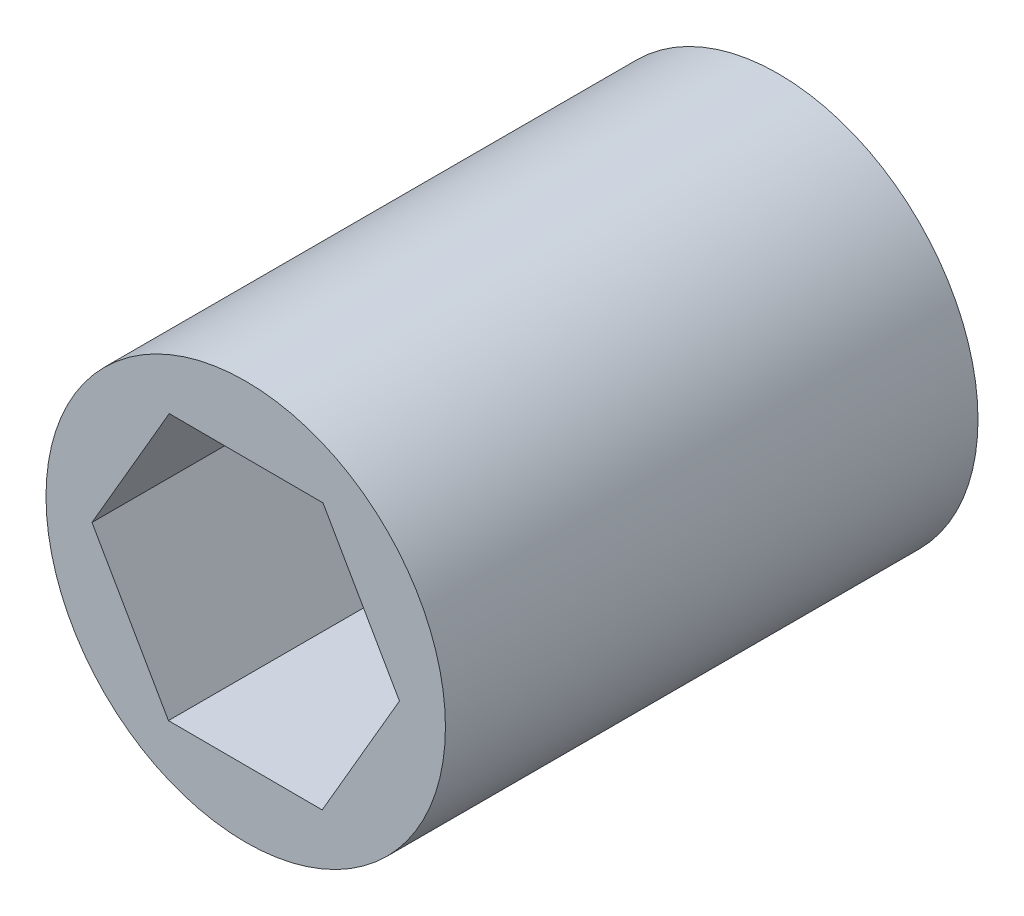
ISO-10303-21;
HEADER;
FILE_DESCRIPTION(('STEP AP214'),'2;1');
FILE_NAME('part.step','',(''),(''),'','','');
FILE_SCHEMA(('AUTOMOTIVE_DESIGN { 1 0 10303 214 1 1 1 1 }'));
ENDSEC;
DATA;
#1=APPLICATION_CONTEXT('core data for automotive mechanical design processes');
#2=APPLICATION_PROTOCOL_DEFINITION('international standard','automotive_design',2000,#1);
#3=PRODUCT_CONTEXT('',#1,'mechanical');
#4=PRODUCT('Part','Part','',(#3));
#5=PRODUCT_RELATED_PRODUCT_CATEGORY('part','',(#4));
#6=PRODUCT_DEFINITION_FORMATION('','',#4);
#7=PRODUCT_DEFINITION_CONTEXT('part definition',#1,'design');
#8=PRODUCT_DEFINITION('design','',#6,#7);
#9=PRODUCT_DEFINITION_SHAPE('','',#8);
#10=(LENGTH_UNIT() NAMED_UNIT(*) SI_UNIT(.MILLI.,.METRE.));
#11=(NAMED_UNIT(*) PLANE_ANGLE_UNIT() SI_UNIT($,.RADIAN.));
#12=(NAMED_UNIT(*) SI_UNIT($,.STERADIAN.) SOLID_ANGLE_UNIT());
#13=UNCERTAINTY_MEASURE_WITH_UNIT(LENGTH_MEASURE(1.E-05),#10,'distance_accuracy_value','');
#14=(GEOMETRIC_REPRESENTATION_CONTEXT(3) GLOBAL_UNCERTAINTY_ASSIGNED_CONTEXT((#13)) GLOBAL_UNIT_ASSIGNED_CONTEXT((#10,
#11,#12)) REPRESENTATION_CONTEXT('',''));
#15=CARTESIAN_POINT('',(0.,0.,0.));
#16=DIRECTION('',(0.,0.,1.));
#17=DIRECTION('',(1.,0.,0.));
#18=AXIS2_PLACEMENT_3D('',#15,#16,#17);
#19=CARTESIAN_POINT('',(0.,0.,25.4));
#20=DIRECTION('',(0.,0.,1.));
#21=DIRECTION('',(1.,0.,0.));
#22=AXIS2_PLACEMENT_3D('',#19,#20,#21);
#23=PLANE('',#22);
#24=CARTESIAN_POINT('',(0.,0.,25.4));
#25=DIRECTION('',(0.,0.,1.));
#26=DIRECTION('',(1.,0.,0.));
#27=AXIS2_PLACEMENT_3D('',#24,#25,#26);
#28=CIRCLE('',#27,9.525);
#29=CARTESIAN_POINT('',(9.525,0.,25.4));
#30=VERTEX_POINT('',#29);
#31=EDGE_CURVE('E11',#30,#30,#28,.T.);
#32=ORIENTED_EDGE('',*,*,#31,.T.);
#33=EDGE_LOOP('',(#32));
#34=FACE_BOUND('',#33,.T.);
#35=DIRECTION('',(0.502611333572125,0.864512491156056,0.));
#36=VECTOR('',#35,1.);
#37=CARTESIAN_POINT('',(3.64699361036975,-6.36103536692381,25.4));
#38=LINE('',#37,#36);
#39=CARTESIAN_POINT('',(3.64699361036975,-6.36103536692381,25.4));
#40=VERTEX_POINT('',#39);
#41=CARTESIAN_POINT('',(7.33231502731217,-0.0221285694421737,25.4));
#42=VERTEX_POINT('',#41);
#43=EDGE_CURVE('E100',#40,#42,#38,.T.);
#44=ORIENTED_EDGE('',*,*,#43,.F.);
#45=DIRECTION('',(0.999995446016177,-0.00301793752540637,0.));
#46=VECTOR('',#45,1.);
#47=CARTESIAN_POINT('',(-3.68532141694241,-6.33890679748164,25.4));
#48=LINE('',#47,#46);
#49=CARTESIAN_POINT('',(-3.68532141694241,-6.33890679748164,25.4));
#50=VERTEX_POINT('',#49);
#51=EDGE_CURVE('E92',#50,#40,#48,.T.);
#52=ORIENTED_EDGE('',*,*,#51,.F.);
#53=DIRECTION('',(0.497384112444053,-0.867530428681462,0.));
#54=VECTOR('',#53,1.);
#55=CARTESIAN_POINT('',(-7.33231502731217,0.022128569442172,25.4));
#56=LINE('',#55,#54);
#57=CARTESIAN_POINT('',(-7.33231502731217,0.022128569442172,25.4));
#58=VERTEX_POINT('',#57);
#59=EDGE_CURVE('E120',#58,#50,#56,.T.);
#60=ORIENTED_EDGE('',*,*,#59,.F.);
#61=DIRECTION('',(-0.502611333572125,-0.864512491156056,0.));
#62=VECTOR('',#61,1.);
#63=CARTESIAN_POINT('',(-3.64699361036976,6.36103536692381,25.4));
#64=LINE('',#63,#62);
#65=CARTESIAN_POINT('',(-3.64699361036976,6.36103536692381,25.4));
#66=VERTEX_POINT('',#65);
#67=EDGE_CURVE('E118',#66,#58,#64,.T.);
#68=ORIENTED_EDGE('',*,*,#67,.F.);
#69=DIRECTION('',(-0.999995446016177,0.00301793752540602,0.));
#70=VECTOR('',#69,1.);
#71=CARTESIAN_POINT('',(3.68532141694241,6.33890679748164,25.4));
#72=LINE('',#71,#70);
#73=CARTESIAN_POINT('',(3.68532141694241,6.33890679748164,25.4));
#74=VERTEX_POINT('',#73);
#75=EDGE_CURVE('E114',#74,#66,#72,.T.);
#76=ORIENTED_EDGE('',*,*,#75,.F.);
#77=DIRECTION('',(-0.497384112444053,0.867530428681462,0.));
#78=VECTOR('',#77,1.);
#79=CARTESIAN_POINT('',(7.33231502731217,-0.0221285694421737,25.4));
#80=LINE('',#79,#78);
#81=EDGE_CURVE('E112',#42,#74,#80,.T.);
#82=ORIENTED_EDGE('',*,*,#81,.F.);
#83=EDGE_LOOP('',(#44,#52,#60,#68,#76,#82));
#84=FACE_BOUND('',#83,.T.);
#85=ADVANCED_FACE('F39',(#34,#84),#23,.T.);
#86=CARTESIAN_POINT('',(0.,0.,0.));
#87=DIRECTION('',(0.,0.,1.));
#88=DIRECTION('',(1.,0.,0.));
#89=AXIS2_PLACEMENT_3D('',#86,#87,#88);
#90=PLANE('',#89);
#91=CARTESIAN_POINT('',(0.,0.,0.));
#92=DIRECTION('',(0.,0.,1.));
#93=DIRECTION('',(1.,0.,0.));
#94=AXIS2_PLACEMENT_3D('',#91,#92,#93);
#95=CIRCLE('',#94,9.525);
#96=CARTESIAN_POINT('',(9.525,0.,0.));
#97=VERTEX_POINT('',#96);
#98=EDGE_CURVE('E43',#97,#97,#95,.T.);
#99=ORIENTED_EDGE('',*,*,#98,.F.);
#100=EDGE_LOOP('',(#99));
#101=FACE_BOUND('',#100,.T.);
#102=DIRECTION('',(0.999995446016177,-0.00301793752540637,0.));
#103=VECTOR('',#102,1.);
#104=CARTESIAN_POINT('',(-3.68532141694241,-6.33890679748164,0.));
#105=LINE('',#104,#103);
#106=CARTESIAN_POINT('',(-3.68532141694241,-6.33890679748164,0.));
#107=VERTEX_POINT('',#106);
#108=CARTESIAN_POINT('',(3.64699361036975,-6.36103536692381,0.));
#109=VERTEX_POINT('',#108);
#110=EDGE_CURVE('E62',#107,#109,#105,.T.);
#111=ORIENTED_EDGE('',*,*,#110,.T.);
#112=DIRECTION('',(0.502611333572125,0.864512491156056,0.));
#113=VECTOR('',#112,1.);
#114=CARTESIAN_POINT('',(3.64699361036975,-6.36103536692381,0.));
#115=LINE('',#114,#113);
#116=CARTESIAN_POINT('',(7.33231502731217,-0.0221285694421737,0.));
#117=VERTEX_POINT('',#116);
#118=EDGE_CURVE('E107',#109,#117,#115,.T.);
#119=ORIENTED_EDGE('',*,*,#118,.T.);
#120=DIRECTION('',(-0.497384112444053,0.867530428681462,0.));
#121=VECTOR('',#120,1.);
#122=CARTESIAN_POINT('',(7.33231502731217,-0.0221285694421737,0.));
#123=LINE('',#122,#121);
#124=CARTESIAN_POINT('',(3.68532141694241,6.33890679748164,0.));
#125=VERTEX_POINT('',#124);
#126=EDGE_CURVE('E124',#117,#125,#123,.T.);
#127=ORIENTED_EDGE('',*,*,#126,.T.);
#128=DIRECTION('',(-0.999995446016177,0.00301793752540602,0.));
#129=VECTOR('',#128,1.);
#130=CARTESIAN_POINT('',(3.68532141694241,6.33890679748164,0.));
#131=LINE('',#130,#129);
#132=CARTESIAN_POINT('',(-3.64699361036976,6.36103536692381,0.));
#133=VERTEX_POINT('',#132);
#134=EDGE_CURVE('E127',#125,#133,#131,.T.);
#135=ORIENTED_EDGE('',*,*,#134,.T.);
#136=DIRECTION('',(-0.502611333572125,-0.864512491156056,0.));
#137=VECTOR('',#136,1.);
#138=CARTESIAN_POINT('',(-3.64699361036976,6.36103536692381,0.));
#139=LINE('',#138,#137);
#140=CARTESIAN_POINT('',(-7.33231502731217,0.022128569442172,0.));
#141=VERTEX_POINT('',#140);
#142=EDGE_CURVE('E130',#133,#141,#139,.T.);
#143=ORIENTED_EDGE('',*,*,#142,.T.);
#144=DIRECTION('',(0.497384112444053,-0.867530428681462,0.));
#145=VECTOR('',#144,1.);
#146=CARTESIAN_POINT('',(-7.33231502731217,0.022128569442172,0.));
#147=LINE('',#146,#145);
#148=EDGE_CURVE('E101',#141,#107,#147,.T.);
#149=ORIENTED_EDGE('',*,*,#148,.T.);
#150=EDGE_LOOP('',(#111,#119,#127,#135,#143,#149));
#151=FACE_BOUND('',#150,.T.);
#152=ADVANCED_FACE('F147',(#101,#151),#90,.F.);
#153=CARTESIAN_POINT('',(0.,0.,25.4));
#154=DIRECTION('',(0.,0.,-1.));
#155=DIRECTION('',(-1.,0.,0.));
#156=AXIS2_PLACEMENT_3D('',#153,#154,#155);
#157=CYLINDRICAL_SURFACE('',#156,9.525);
#158=ORIENTED_EDGE('',*,*,#31,.F.);
#159=EDGE_LOOP('',(#158));
#160=FACE_BOUND('',#159,.T.);
#161=ORIENTED_EDGE('',*,*,#98,.T.);
#162=EDGE_LOOP('',(#161));
#163=FACE_BOUND('',#162,.T.);
#164=ADVANCED_FACE('F41',(#160,#163),#157,.T.);
#165=CARTESIAN_POINT('',(-3.68532141694241,-6.33890679748164,25.4));
#166=DIRECTION('',(0.00301793752540637,0.999995446016177,0.));
#167=DIRECTION('',(-0.999995446016177,0.00301793752540637,0.));
#168=AXIS2_PLACEMENT_3D('',#165,#166,#167);
#169=PLANE('',#168);
#170=ORIENTED_EDGE('',*,*,#110,.F.);
#171=DIRECTION('',(0.,0.,-1.));
#172=VECTOR('',#171,1.);
#173=CARTESIAN_POINT('',(-3.68532141694241,-6.33890679748164,25.4));
#174=LINE('',#173,#172);
#175=EDGE_CURVE('E96',#50,#107,#174,.T.);
#176=ORIENTED_EDGE('',*,*,#175,.F.);
#177=ORIENTED_EDGE('',*,*,#51,.T.);
#178=DIRECTION('',(0.,0.,-1.));
#179=VECTOR('',#178,1.);
#180=CARTESIAN_POINT('',(3.64699361036975,-6.36103536692381,25.4));
#181=LINE('',#180,#179);
#182=EDGE_CURVE('E95',#40,#109,#181,.T.);
#183=ORIENTED_EDGE('',*,*,#182,.T.);
#184=EDGE_LOOP('',(#170,#176,#177,#183));
#185=FACE_BOUND('',#184,.T.);
#186=ADVANCED_FACE('F94',(#185),#169,.T.);
#187=CARTESIAN_POINT('',(3.64699361036975,-6.36103536692381,25.4));
#188=DIRECTION('',(-0.864512491156056,0.502611333572125,0.));
#189=DIRECTION('',(-0.502611333572125,-0.864512491156056,0.));
#190=AXIS2_PLACEMENT_3D('',#187,#188,#189);
#191=PLANE('',#190);
#192=ORIENTED_EDGE('',*,*,#118,.F.);
#193=ORIENTED_EDGE('',*,*,#182,.F.);
#194=ORIENTED_EDGE('',*,*,#43,.T.);
#195=DIRECTION('',(0.,0.,-1.));
#196=VECTOR('',#195,1.);
#197=CARTESIAN_POINT('',(7.33231502731217,-0.0221285694421737,25.4));
#198=LINE('',#197,#196);
#199=EDGE_CURVE('E108',#42,#117,#198,.T.);
#200=ORIENTED_EDGE('',*,*,#199,.T.);
#201=EDGE_LOOP('',(#192,#193,#194,#200));
#202=FACE_BOUND('',#201,.T.);
#203=ADVANCED_FACE('F104',(#202),#191,.T.);
#204=CARTESIAN_POINT('',(7.33231502731217,-0.0221285694421737,25.4));
#205=DIRECTION('',(-0.867530428681462,-0.497384112444053,0.));
#206=DIRECTION('',(0.497384112444053,-0.867530428681462,0.));
#207=AXIS2_PLACEMENT_3D('',#204,#205,#206);
#208=PLANE('',#207);
#209=ORIENTED_EDGE('',*,*,#126,.F.);
#210=ORIENTED_EDGE('',*,*,#199,.F.);
#211=ORIENTED_EDGE('',*,*,#81,.T.);
#212=DIRECTION('',(0.,0.,-1.));
#213=VECTOR('',#212,1.);
#214=CARTESIAN_POINT('',(3.68532141694241,6.33890679748164,25.4));
#215=LINE('',#214,#213);
#216=EDGE_CURVE('E139',#74,#125,#215,.T.);
#217=ORIENTED_EDGE('',*,*,#216,.T.);
#218=EDGE_LOOP('',(#209,#210,#211,#217));
#219=FACE_BOUND('',#218,.T.);
#220=ADVANCED_FACE('F143',(#219),#208,.T.);
#221=CARTESIAN_POINT('',(3.68532141694241,6.33890679748164,25.4));
#222=DIRECTION('',(-0.00301793752540602,-0.999995446016177,0.));
#223=DIRECTION('',(0.999995446016177,-0.00301793752540602,0.));
#224=AXIS2_PLACEMENT_3D('',#221,#222,#223);
#225=PLANE('',#224);
#226=ORIENTED_EDGE('',*,*,#134,.F.);
#227=ORIENTED_EDGE('',*,*,#216,.F.);
#228=ORIENTED_EDGE('',*,*,#75,.T.);
#229=DIRECTION('',(0.,0.,-1.));
#230=VECTOR('',#229,1.);
#231=CARTESIAN_POINT('',(-3.64699361036976,6.36103536692381,25.4));
#232=LINE('',#231,#230);
#233=EDGE_CURVE('E137',#66,#133,#232,.T.);
#234=ORIENTED_EDGE('',*,*,#233,.T.);
#235=EDGE_LOOP('',(#226,#227,#228,#234));
#236=FACE_BOUND('',#235,.T.);
#237=ADVANCED_FACE('F155',(#236),#225,.T.);
#238=CARTESIAN_POINT('',(-3.64699361036976,6.36103536692381,25.4));
#239=DIRECTION('',(0.864512491156056,-0.502611333572125,0.));
#240=DIRECTION('',(0.502611333572125,0.864512491156056,0.));
#241=AXIS2_PLACEMENT_3D('',#238,#239,#240);
#242=PLANE('',#241);
#243=ORIENTED_EDGE('',*,*,#142,.F.);
#244=ORIENTED_EDGE('',*,*,#233,.F.);
#245=ORIENTED_EDGE('',*,*,#67,.T.);
#246=DIRECTION('',(0.,0.,-1.));
#247=VECTOR('',#246,1.);
#248=CARTESIAN_POINT('',(-7.33231502731217,0.022128569442172,25.4));
#249=LINE('',#248,#247);
#250=EDGE_CURVE('E54',#58,#141,#249,.T.);
#251=ORIENTED_EDGE('',*,*,#250,.T.);
#252=EDGE_LOOP('',(#243,#244,#245,#251));
#253=FACE_BOUND('',#252,.T.);
#254=ADVANCED_FACE('F153',(#253),#242,.T.);
#255=CARTESIAN_POINT('',(-7.33231502731217,0.022128569442172,25.4));
#256=DIRECTION('',(0.867530428681462,0.497384112444053,0.));
#257=DIRECTION('',(-0.497384112444053,0.867530428681462,0.));
#258=AXIS2_PLACEMENT_3D('',#255,#256,#257);
#259=PLANE('',#258);
#260=ORIENTED_EDGE('',*,*,#148,.F.);
#261=ORIENTED_EDGE('',*,*,#250,.F.);
#262=ORIENTED_EDGE('',*,*,#59,.T.);
#263=ORIENTED_EDGE('',*,*,#175,.T.);
#264=EDGE_LOOP('',(#260,#261,#262,#263));
#265=FACE_BOUND('',#264,.T.);
#266=ADVANCED_FACE('F149',(#265),#259,.T.);
#267=CLOSED_SHELL('',(#85,#152,#164,#186,#203,#220,#237,#254,#266));
#268=MANIFOLD_SOLID_BREP('B2',#267);
#269=ADVANCED_BREP_SHAPE_REPRESENTATION('',(#18,#268),#14);
#270=SHAPE_DEFINITION_REPRESENTATION(#9,#269);
ENDSEC;
END-ISO-10303-21;
